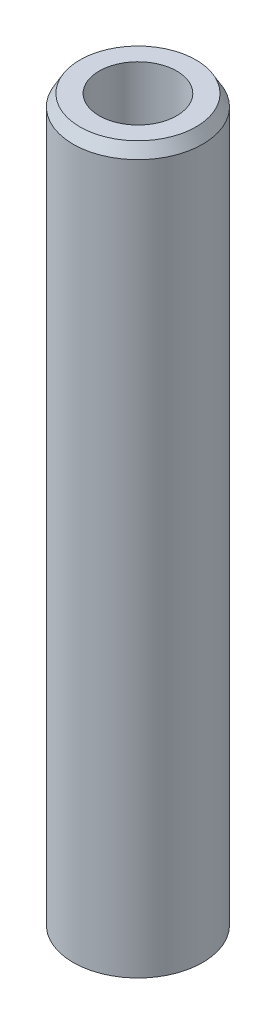
ISO-10303-21;
HEADER;
FILE_DESCRIPTION(('STEP AP214'),'2;1');
FILE_NAME('part.step','',(''),(''),'','','');
FILE_SCHEMA(('AUTOMOTIVE_DESIGN { 1 0 10303 214 1 1 1 1 }'));
ENDSEC;
DATA;
#1=APPLICATION_CONTEXT('core data for automotive mechanical design processes');
#2=APPLICATION_PROTOCOL_DEFINITION('international standard','automotive_design',2000,#1);
#3=PRODUCT_CONTEXT('',#1,'mechanical');
#4=PRODUCT('Part','Part','',(#3));
#5=PRODUCT_RELATED_PRODUCT_CATEGORY('part','',(#4));
#6=PRODUCT_DEFINITION_FORMATION('','',#4);
#7=PRODUCT_DEFINITION_CONTEXT('part definition',#1,'design');
#8=PRODUCT_DEFINITION('design','',#6,#7);
#9=PRODUCT_DEFINITION_SHAPE('','',#8);
#10=(LENGTH_UNIT() NAMED_UNIT(*) SI_UNIT(.MILLI.,.METRE.));
#11=(NAMED_UNIT(*) PLANE_ANGLE_UNIT() SI_UNIT($,.RADIAN.));
#12=(NAMED_UNIT(*) SI_UNIT($,.STERADIAN.) SOLID_ANGLE_UNIT());
#13=UNCERTAINTY_MEASURE_WITH_UNIT(LENGTH_MEASURE(1.E-05),#10,'distance_accuracy_value','');
#14=(GEOMETRIC_REPRESENTATION_CONTEXT(3) GLOBAL_UNCERTAINTY_ASSIGNED_CONTEXT((#13)) GLOBAL_UNIT_ASSIGNED_CONTEXT((#10,
#11,#12)) REPRESENTATION_CONTEXT('',''));
#15=CARTESIAN_POINT('',(0.,0.,0.));
#16=DIRECTION('',(0.,0.,1.));
#17=DIRECTION('',(1.,0.,0.));
#18=AXIS2_PLACEMENT_3D('',#15,#16,#17);
#19=CARTESIAN_POINT('',(0.,336.736956735861,0.));
#20=DIRECTION('',(0.,-1.,0.));
#21=DIRECTION('',(0.,0.,-1.));
#22=AXIS2_PLACEMENT_3D('',#19,#20,#21);
#23=CYLINDRICAL_SURFACE('',#22,30.);
#24=CARTESIAN_POINT('',(0.,331.347442724963,0.));
#25=DIRECTION('',(0.,1.,0.));
#26=DIRECTION('',(0.,0.,1.));
#27=AXIS2_PLACEMENT_3D('',#24,#25,#26);
#28=CIRCLE('',#27,30.);
#29=CARTESIAN_POINT('',(0.,331.347442724963,30.));
#30=VERTEX_POINT('',#29);
#31=EDGE_CURVE('E50',#30,#30,#28,.F.);
#32=ORIENTED_EDGE('',*,*,#31,.T.);
#33=EDGE_LOOP('',(#32));
#34=FACE_BOUND('',#33,.T.);
#35=CARTESIAN_POINT('',(0.,3.11163736499342,0.));
#36=DIRECTION('',(0.,1.,0.));
#37=DIRECTION('',(0.,0.,1.));
#38=AXIS2_PLACEMENT_3D('',#35,#36,#37);
#39=CIRCLE('',#38,30.);
#40=CARTESIAN_POINT('',(0.,3.11163736499342,30.));
#41=VERTEX_POINT('',#40);
#42=EDGE_CURVE('E51',#41,#41,#39,.T.);
#43=ORIENTED_EDGE('',*,*,#42,.T.);
#44=EDGE_LOOP('',(#43));
#45=FACE_BOUND('',#44,.T.);
#46=ADVANCED_FACE('F39',(#34,#45),#23,.T.);
#47=CARTESIAN_POINT('',(0.,336.736956735861,0.));
#48=DIRECTION('',(0.,1.,0.));
#49=DIRECTION('',(0.,0.,1.));
#50=AXIS2_PLACEMENT_3D('',#47,#48,#49);
#51=PLANE('',#50);
#52=CARTESIAN_POINT('',(0.,336.736956735861,0.));
#53=DIRECTION('',(0.,1.,0.));
#54=DIRECTION('',(0.,0.,1.));
#55=AXIS2_PLACEMENT_3D('',#52,#53,#54);
#56=CIRCLE('',#55,26.8883626350066);
#57=CARTESIAN_POINT('',(0.,336.736956735861,26.8883626350066));
#58=VERTEX_POINT('',#57);
#59=EDGE_CURVE('E54',#58,#58,#56,.T.);
#60=ORIENTED_EDGE('',*,*,#59,.T.);
#61=EDGE_LOOP('',(#60));
#62=FACE_BOUND('',#61,.T.);
#63=CARTESIAN_POINT('',(0.,336.736956735861,0.));
#64=DIRECTION('',(0.,1.,0.));
#65=DIRECTION('',(0.,0.,1.));
#66=AXIS2_PLACEMENT_3D('',#63,#64,#65);
#67=CIRCLE('',#66,17.9678522002739);
#68=CARTESIAN_POINT('',(0.,336.736956735861,17.9678522002739));
#69=VERTEX_POINT('',#68);
#70=EDGE_CURVE('E58',#69,#69,#67,.T.);
#71=ORIENTED_EDGE('',*,*,#70,.F.);
#72=EDGE_LOOP('',(#71));
#73=FACE_BOUND('',#72,.T.);
#74=ADVANCED_FACE('F69',(#62,#73),#51,.T.);
#75=CARTESIAN_POINT('',(0.,0.,0.));
#76=DIRECTION('',(0.,1.,0.));
#77=DIRECTION('',(0.,0.,1.));
#78=AXIS2_PLACEMENT_3D('',#75,#76,#77);
#79=PLANE('',#78);
#80=CARTESIAN_POINT('',(0.,0.,0.));
#81=DIRECTION('',(0.,1.,0.));
#82=DIRECTION('',(0.,0.,1.));
#83=AXIS2_PLACEMENT_3D('',#80,#81,#82);
#84=CIRCLE('',#83,24.6104859891016);
#85=CARTESIAN_POINT('',(0.,0.,24.6104859891016));
#86=VERTEX_POINT('',#85);
#87=EDGE_CURVE('E10',#86,#86,#84,.F.);
#88=ORIENTED_EDGE('',*,*,#87,.T.);
#89=EDGE_LOOP('',(#88));
#90=FACE_BOUND('',#89,.T.);
#91=CARTESIAN_POINT('',(0.,0.,0.));
#92=DIRECTION('',(0.,1.,0.));
#93=DIRECTION('',(0.,0.,1.));
#94=AXIS2_PLACEMENT_3D('',#91,#92,#93);
#95=CIRCLE('',#94,17.9678522002739);
#96=CARTESIAN_POINT('',(0.,0.,17.9678522002739));
#97=VERTEX_POINT('',#96);
#98=EDGE_CURVE('E63',#97,#97,#95,.T.);
#99=ORIENTED_EDGE('',*,*,#98,.T.);
#100=EDGE_LOOP('',(#99));
#101=FACE_BOUND('',#100,.T.);
#102=ADVANCED_FACE('F75',(#90,#101),#79,.F.);
#103=CARTESIAN_POINT('',(0.,336.736956735861,0.));
#104=DIRECTION('',(0.,-1.,0.));
#105=DIRECTION('',(0.,0.,-1.));
#106=AXIS2_PLACEMENT_3D('',#103,#104,#105);
#107=CYLINDRICAL_SURFACE('',#106,17.9678522002739);
#108=ORIENTED_EDGE('',*,*,#70,.T.);
#109=EDGE_LOOP('',(#108));
#110=FACE_BOUND('',#109,.T.);
#111=ORIENTED_EDGE('',*,*,#98,.F.);
#112=EDGE_LOOP('',(#111));
#113=FACE_BOUND('',#112,.T.);
#114=ADVANCED_FACE('F70',(#110,#113),#107,.F.);
#115=CARTESIAN_POINT('',(0.,336.736956735861,0.));
#116=DIRECTION('',(0.,-1.,0.));
#117=DIRECTION('',(0.,0.,-1.));
#118=AXIS2_PLACEMENT_3D('',#115,#116,#117);
#119=CONICAL_SURFACE('',#118,26.8883626350066,0.523598775598303);
#120=ORIENTED_EDGE('',*,*,#31,.F.);
#121=EDGE_LOOP('',(#120));
#122=FACE_BOUND('',#121,.T.);
#123=ORIENTED_EDGE('',*,*,#59,.F.);
#124=EDGE_LOOP('',(#123));
#125=FACE_BOUND('',#124,.T.);
#126=ADVANCED_FACE('F81',(#122,#125),#119,.T.);
#127=CARTESIAN_POINT('',(0.,3.11163736499342,0.));
#128=DIRECTION('',(0.,1.,0.));
#129=DIRECTION('',(0.,0.,1.));
#130=AXIS2_PLACEMENT_3D('',#127,#128,#129);
#131=CONICAL_SURFACE('',#130,30.,1.0471975511966);
#132=ORIENTED_EDGE('',*,*,#87,.F.);
#133=EDGE_LOOP('',(#132));
#134=FACE_BOUND('',#133,.T.);
#135=ORIENTED_EDGE('',*,*,#42,.F.);
#136=EDGE_LOOP('',(#135));
#137=FACE_BOUND('',#136,.T.);
#138=ADVANCED_FACE('F45',(#134,#137),#131,.T.);
#139=CLOSED_SHELL('',(#46,#74,#102,#114,#126,#138));
#140=MANIFOLD_SOLID_BREP('B2',#139);
#141=ADVANCED_BREP_SHAPE_REPRESENTATION('',(#18,#140),#14);
#142=SHAPE_DEFINITION_REPRESENTATION(#9,#141);
ENDSEC;
END-ISO-10303-21;
